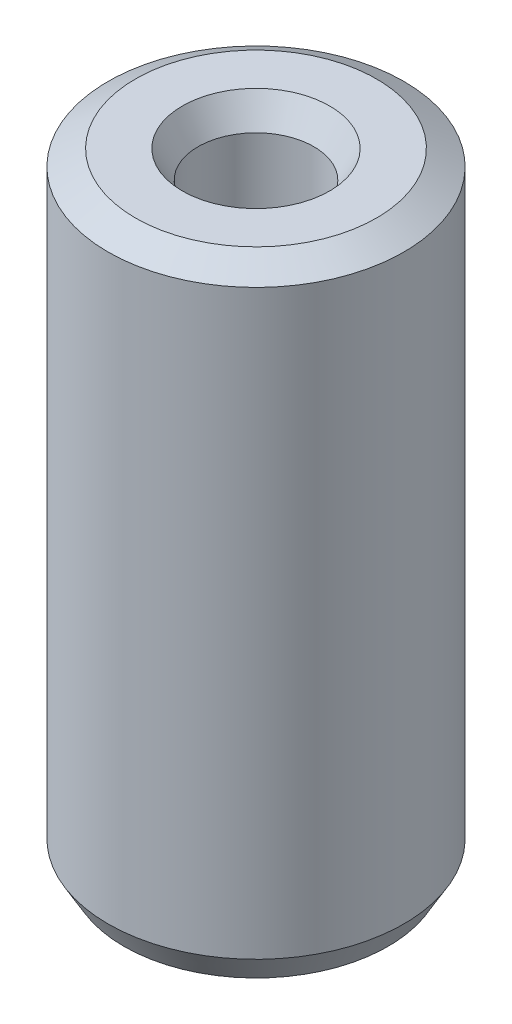
ISO-10303-21;
HEADER;
FILE_DESCRIPTION(('STEP AP214'),'2;1');
FILE_NAME('part.step','',(''),(''),'','','');
FILE_SCHEMA(('AUTOMOTIVE_DESIGN { 1 0 10303 214 1 1 1 1 }'));
ENDSEC;
DATA;
#1=APPLICATION_CONTEXT('core data for automotive mechanical design processes');
#2=APPLICATION_PROTOCOL_DEFINITION('international standard','automotive_design',2000,#1);
#3=PRODUCT_CONTEXT('',#1,'mechanical');
#4=PRODUCT('Part','Part','',(#3));
#5=PRODUCT_RELATED_PRODUCT_CATEGORY('part','',(#4));
#6=PRODUCT_DEFINITION_FORMATION('','',#4);
#7=PRODUCT_DEFINITION_CONTEXT('part definition',#1,'design');
#8=PRODUCT_DEFINITION('design','',#6,#7);
#9=PRODUCT_DEFINITION_SHAPE('','',#8);
#10=(LENGTH_UNIT() NAMED_UNIT(*) SI_UNIT(.MILLI.,.METRE.));
#11=(NAMED_UNIT(*) PLANE_ANGLE_UNIT() SI_UNIT($,.RADIAN.));
#12=(NAMED_UNIT(*) SI_UNIT($,.STERADIAN.) SOLID_ANGLE_UNIT());
#13=UNCERTAINTY_MEASURE_WITH_UNIT(LENGTH_MEASURE(1.E-05),#10,'distance_accuracy_value','');
#14=(GEOMETRIC_REPRESENTATION_CONTEXT(3) GLOBAL_UNCERTAINTY_ASSIGNED_CONTEXT((#13)) GLOBAL_UNIT_ASSIGNED_CONTEXT((#10,
#11,#12)) REPRESENTATION_CONTEXT('',''));
#15=CARTESIAN_POINT('',(0.,0.,0.));
#16=DIRECTION('',(0.,0.,1.));
#17=DIRECTION('',(1.,0.,0.));
#18=AXIS2_PLACEMENT_3D('',#15,#16,#17);
#19=CARTESIAN_POINT('',(0.,147.942980351356,0.));
#20=DIRECTION('',(0.,-1.,0.));
#21=DIRECTION('',(0.,0.,-1.));
#22=AXIS2_PLACEMENT_3D('',#19,#20,#21);
#23=CYLINDRICAL_SURFACE('',#22,35.);
#24=CARTESIAN_POINT('',(0.,6.47261139174679,0.));
#25=DIRECTION('',(0.,1.,0.));
#26=DIRECTION('',(0.,0.,1.));
#27=AXIS2_PLACEMENT_3D('',#24,#25,#26);
#28=CIRCLE('',#27,35.);
#29=CARTESIAN_POINT('',(0.,6.47261139174679,35.));
#30=VERTEX_POINT('',#29);
#31=EDGE_CURVE('E10',#30,#30,#28,.T.);
#32=ORIENTED_EDGE('',*,*,#31,.T.);
#33=EDGE_LOOP('',(#32));
#34=FACE_BOUND('',#33,.T.);
#35=CARTESIAN_POINT('',(0.,144.206016421971,0.));
#36=DIRECTION('',(0.,1.,0.));
#37=DIRECTION('',(0.,0.,1.));
#38=AXIS2_PLACEMENT_3D('',#35,#36,#37);
#39=CIRCLE('',#38,35.);
#40=CARTESIAN_POINT('',(0.,144.206016421971,35.));
#41=VERTEX_POINT('',#40);
#42=EDGE_CURVE('E50',#41,#41,#39,.F.);
#43=ORIENTED_EDGE('',*,*,#42,.T.);
#44=EDGE_LOOP('',(#43));
#45=FACE_BOUND('',#44,.T.);
#46=ADVANCED_FACE('F39',(#34,#45),#23,.T.);
#47=CARTESIAN_POINT('',(0.,147.942980351356,0.));
#48=DIRECTION('',(0.,1.,0.));
#49=DIRECTION('',(0.,0.,1.));
#50=AXIS2_PLACEMENT_3D('',#47,#48,#49);
#51=PLANE('',#50);
#52=CARTESIAN_POINT('',(0.,147.942980351356,0.));
#53=DIRECTION('',(0.,1.,0.));
#54=DIRECTION('',(0.,0.,1.));
#55=AXIS2_PLACEMENT_3D('',#52,#53,#54);
#56=CIRCLE('',#55,17.439087972535);
#57=CARTESIAN_POINT('',(0.,147.942980351356,17.439087972535));
#58=VERTEX_POINT('',#57);
#59=EDGE_CURVE('E58',#58,#58,#56,.F.);
#60=ORIENTED_EDGE('',*,*,#59,.T.);
#61=EDGE_LOOP('',(#60));
#62=FACE_BOUND('',#61,.T.);
#63=CARTESIAN_POINT('',(0.,147.942980351356,0.));
#64=DIRECTION('',(0.,1.,0.));
#65=DIRECTION('',(0.,0.,1.));
#66=AXIS2_PLACEMENT_3D('',#63,#64,#65);
#67=CIRCLE('',#66,28.5273886082532);
#68=CARTESIAN_POINT('',(0.,147.942980351356,28.5273886082532));
#69=VERTEX_POINT('',#68);
#70=EDGE_CURVE('E61',#69,#69,#67,.T.);
#71=ORIENTED_EDGE('',*,*,#70,.T.);
#72=EDGE_LOOP('',(#71));
#73=FACE_BOUND('',#72,.T.);
#74=ADVANCED_FACE('F88',(#62,#73),#51,.T.);
#75=CARTESIAN_POINT('',(0.,0.,0.));
#76=DIRECTION('',(0.,1.,0.));
#77=DIRECTION('',(0.,0.,1.));
#78=AXIS2_PLACEMENT_3D('',#75,#76,#77);
#79=PLANE('',#78);
#80=CARTESIAN_POINT('',(0.,0.,0.));
#81=DIRECTION('',(0.,1.,0.));
#82=DIRECTION('',(0.,0.,1.));
#83=AXIS2_PLACEMENT_3D('',#80,#81,#82);
#84=CIRCLE('',#83,20.174735434897);
#85=CARTESIAN_POINT('',(0.,0.,20.174735434897));
#86=VERTEX_POINT('',#85);
#87=EDGE_CURVE('E51',#86,#86,#84,.T.);
#88=ORIENTED_EDGE('',*,*,#87,.T.);
#89=EDGE_LOOP('',(#88));
#90=FACE_BOUND('',#89,.T.);
#91=CARTESIAN_POINT('',(0.,0.,0.));
#92=DIRECTION('',(0.,1.,0.));
#93=DIRECTION('',(0.,0.,1.));
#94=AXIS2_PLACEMENT_3D('',#91,#92,#93);
#95=CIRCLE('',#94,31.2630360706151);
#96=CARTESIAN_POINT('',(0.,0.,31.2630360706151));
#97=VERTEX_POINT('',#96);
#98=EDGE_CURVE('E54',#97,#97,#95,.F.);
#99=ORIENTED_EDGE('',*,*,#98,.T.);
#100=EDGE_LOOP('',(#99));
#101=FACE_BOUND('',#100,.T.);
#102=ADVANCED_FACE('F83',(#90,#101),#79,.F.);
#103=CARTESIAN_POINT('',(0.,147.942980351356,0.));
#104=DIRECTION('',(0.,-1.,0.));
#105=DIRECTION('',(0.,0.,-1.));
#106=AXIS2_PLACEMENT_3D('',#103,#104,#105);
#107=CYLINDRICAL_SURFACE('',#106,13.7021240431502);
#108=CARTESIAN_POINT('',(0.,141.470368959609,0.));
#109=DIRECTION('',(0.,1.,0.));
#110=DIRECTION('',(0.,0.,1.));
#111=AXIS2_PLACEMENT_3D('',#108,#109,#110);
#112=CIRCLE('',#111,13.7021240431502);
#113=CARTESIAN_POINT('',(0.,141.470368959609,13.7021240431502));
#114=VERTEX_POINT('',#113);
#115=EDGE_CURVE('E67',#114,#114,#112,.T.);
#116=ORIENTED_EDGE('',*,*,#115,.T.);
#117=EDGE_LOOP('',(#116));
#118=FACE_BOUND('',#117,.T.);
#119=CARTESIAN_POINT('',(0.,3.73696392938491,0.));
#120=DIRECTION('',(0.,1.,0.));
#121=DIRECTION('',(0.,0.,1.));
#122=AXIS2_PLACEMENT_3D('',#119,#120,#121);
#123=CIRCLE('',#122,13.7021240431502);
#124=CARTESIAN_POINT('',(0.,3.73696392938491,13.7021240431502));
#125=VERTEX_POINT('',#124);
#126=EDGE_CURVE('E69',#125,#125,#123,.F.);
#127=ORIENTED_EDGE('',*,*,#126,.T.);
#128=EDGE_LOOP('',(#127));
#129=FACE_BOUND('',#128,.T.);
#130=ADVANCED_FACE('F71',(#118,#129),#107,.F.);
#131=CARTESIAN_POINT('',(0.,141.470368959609,0.));
#132=DIRECTION('',(0.,1.,0.));
#133=DIRECTION('',(0.,0.,1.));
#134=AXIS2_PLACEMENT_3D('',#131,#132,#133);
#135=CONICAL_SURFACE('',#134,13.7021240431502,0.523598775598301);
#136=ORIENTED_EDGE('',*,*,#59,.F.);
#137=EDGE_LOOP('',(#136));
#138=FACE_BOUND('',#137,.T.);
#139=ORIENTED_EDGE('',*,*,#115,.F.);
#140=EDGE_LOOP('',(#139));
#141=FACE_BOUND('',#140,.T.);
#142=ADVANCED_FACE('F77',(#138,#141),#135,.F.);
#143=CARTESIAN_POINT('',(0.,0.,0.));
#144=DIRECTION('',(0.,-1.,0.));
#145=DIRECTION('',(0.,0.,-1.));
#146=AXIS2_PLACEMENT_3D('',#143,#144,#145);
#147=CONICAL_SURFACE('',#146,20.174735434897,1.04719755119659);
#148=ORIENTED_EDGE('',*,*,#126,.F.);
#149=EDGE_LOOP('',(#148));
#150=FACE_BOUND('',#149,.T.);
#151=ORIENTED_EDGE('',*,*,#87,.F.);
#152=EDGE_LOOP('',(#151));
#153=FACE_BOUND('',#152,.T.);
#154=ADVANCED_FACE('F73',(#150,#153),#147,.F.);
#155=CARTESIAN_POINT('',(0.,6.47261139174679,0.));
#156=DIRECTION('',(0.,1.,0.));
#157=DIRECTION('',(0.,0.,1.));
#158=AXIS2_PLACEMENT_3D('',#155,#156,#157);
#159=CONICAL_SURFACE('',#158,35.,0.523598775598301);
#160=ORIENTED_EDGE('',*,*,#98,.F.);
#161=EDGE_LOOP('',(#160));
#162=FACE_BOUND('',#161,.T.);
#163=ORIENTED_EDGE('',*,*,#31,.F.);
#164=EDGE_LOOP('',(#163));
#165=FACE_BOUND('',#164,.T.);
#166=ADVANCED_FACE('F76',(#162,#165),#159,.T.);
#167=CARTESIAN_POINT('',(0.,147.942980351356,0.));
#168=DIRECTION('',(0.,-1.,0.));
#169=DIRECTION('',(0.,0.,-1.));
#170=AXIS2_PLACEMENT_3D('',#167,#168,#169);
#171=CONICAL_SURFACE('',#170,28.5273886082532,1.04719755119659);
#172=ORIENTED_EDGE('',*,*,#42,.F.);
#173=EDGE_LOOP('',(#172));
#174=FACE_BOUND('',#173,.T.);
#175=ORIENTED_EDGE('',*,*,#70,.F.);
#176=EDGE_LOOP('',(#175));
#177=FACE_BOUND('',#176,.T.);
#178=ADVANCED_FACE('F45',(#174,#177),#171,.T.);
#179=CLOSED_SHELL('',(#46,#74,#102,#130,#142,#154,#166,#178));
#180=MANIFOLD_SOLID_BREP('B2',#179);
#181=ADVANCED_BREP_SHAPE_REPRESENTATION('',(#18,#180),#14);
#182=SHAPE_DEFINITION_REPRESENTATION(#9,#181);
ENDSEC;
END-ISO-10303-21;
